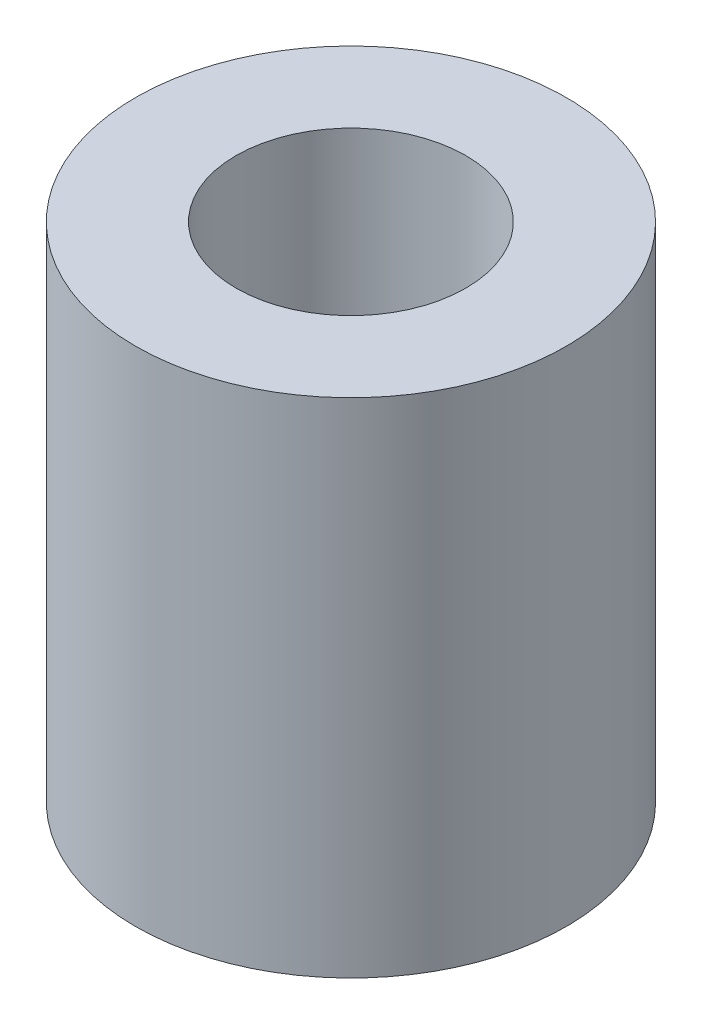
ISO-10303-21;
HEADER;
FILE_DESCRIPTION(('STEP AP214'),'2;1');
FILE_NAME('part.step','',(''),(''),'','','');
FILE_SCHEMA(('AUTOMOTIVE_DESIGN { 1 0 10303 214 1 1 1 1 }'));
ENDSEC;
DATA;
#1=APPLICATION_CONTEXT('core data for automotive mechanical design processes');
#2=APPLICATION_PROTOCOL_DEFINITION('international standard','automotive_design',2000,#1);
#3=PRODUCT_CONTEXT('',#1,'mechanical');
#4=PRODUCT('Part','Part','',(#3));
#5=PRODUCT_RELATED_PRODUCT_CATEGORY('part','',(#4));
#6=PRODUCT_DEFINITION_FORMATION('','',#4);
#7=PRODUCT_DEFINITION_CONTEXT('part definition',#1,'design');
#8=PRODUCT_DEFINITION('design','',#6,#7);
#9=PRODUCT_DEFINITION_SHAPE('','',#8);
#10=(LENGTH_UNIT() NAMED_UNIT(*) SI_UNIT(.MILLI.,.METRE.));
#11=(NAMED_UNIT(*) PLANE_ANGLE_UNIT() SI_UNIT($,.RADIAN.));
#12=(NAMED_UNIT(*) SI_UNIT($,.STERADIAN.) SOLID_ANGLE_UNIT());
#13=UNCERTAINTY_MEASURE_WITH_UNIT(LENGTH_MEASURE(1.E-05),#10,'distance_accuracy_value','');
#14=(GEOMETRIC_REPRESENTATION_CONTEXT(3) GLOBAL_UNCERTAINTY_ASSIGNED_CONTEXT((#13)) GLOBAL_UNIT_ASSIGNED_CONTEXT((#10,
#11,#12)) REPRESENTATION_CONTEXT('',''));
#15=CARTESIAN_POINT('',(0.,0.,0.));
#16=DIRECTION('',(0.,0.,1.));
#17=DIRECTION('',(1.,0.,0.));
#18=AXIS2_PLACEMENT_3D('',#15,#16,#17);
#19=CARTESIAN_POINT('',(0.,10.,0.));
#20=DIRECTION('',(0.,-1.,0.));
#21=DIRECTION('',(0.,0.,-1.));
#22=AXIS2_PLACEMENT_3D('',#19,#20,#21);
#23=CYLINDRICAL_SURFACE('',#22,3.5);
#24=CARTESIAN_POINT('',(0.,0.,0.));
#25=DIRECTION('',(0.,-1.,0.));
#26=DIRECTION('',(0.,0.,-1.));
#27=AXIS2_PLACEMENT_3D('',#24,#25,#26);
#28=CIRCLE('',#27,3.5);
#29=CARTESIAN_POINT('',(0.,0.,-3.5));
#30=VERTEX_POINT('',#29);
#31=EDGE_CURVE('E54',#30,#30,#28,.T.);
#32=ORIENTED_EDGE('',*,*,#31,.T.);
#33=EDGE_LOOP('',(#32));
#34=FACE_BOUND('',#33,.T.);
#35=CARTESIAN_POINT('',(0.,3.,0.));
#36=DIRECTION('',(0.,1.,0.));
#37=DIRECTION('',(0.,0.,1.));
#38=AXIS2_PLACEMENT_3D('',#35,#36,#37);
#39=CIRCLE('',#38,3.5);
#40=CARTESIAN_POINT('',(0.,3.,3.5));
#41=VERTEX_POINT('',#40);
#42=EDGE_CURVE('E43',#41,#41,#39,.F.);
#43=ORIENTED_EDGE('',*,*,#42,.F.);
#44=EDGE_LOOP('',(#43));
#45=FACE_BOUND('',#44,.T.);
#46=ADVANCED_FACE('F39',(#34,#45),#23,.F.);
#47=CARTESIAN_POINT('',(0.,35.,0.));
#48=DIRECTION('',(0.,-1.,0.));
#49=DIRECTION('',(0.,0.,-1.));
#50=AXIS2_PLACEMENT_3D('',#47,#48,#49);
#51=CYLINDRICAL_SURFACE('',#50,15.);
#52=CARTESIAN_POINT('',(0.,35.,0.));
#53=DIRECTION('',(0.,1.,0.));
#54=DIRECTION('',(0.,0.,1.));
#55=AXIS2_PLACEMENT_3D('',#52,#53,#54);
#56=CIRCLE('',#55,15.);
#57=CARTESIAN_POINT('',(0.,35.,15.));
#58=VERTEX_POINT('',#57);
#59=EDGE_CURVE('E10',#58,#58,#56,.T.);
#60=ORIENTED_EDGE('',*,*,#59,.F.);
#61=EDGE_LOOP('',(#60));
#62=FACE_BOUND('',#61,.T.);
#63=CARTESIAN_POINT('',(0.,0.,0.));
#64=DIRECTION('',(0.,1.,0.));
#65=DIRECTION('',(0.,0.,1.));
#66=AXIS2_PLACEMENT_3D('',#63,#64,#65);
#67=CIRCLE('',#66,15.);
#68=CARTESIAN_POINT('',(0.,0.,15.));
#69=VERTEX_POINT('',#68);
#70=EDGE_CURVE('E48',#69,#69,#67,.T.);
#71=ORIENTED_EDGE('',*,*,#70,.T.);
#72=EDGE_LOOP('',(#71));
#73=FACE_BOUND('',#72,.T.);
#74=ADVANCED_FACE('F41',(#62,#73),#51,.T.);
#75=CARTESIAN_POINT('',(0.,35.,0.));
#76=DIRECTION('',(0.,1.,0.));
#77=DIRECTION('',(0.,0.,1.));
#78=AXIS2_PLACEMENT_3D('',#75,#76,#77);
#79=PLANE('',#78);
#80=CARTESIAN_POINT('',(0.,35.,0.));
#81=DIRECTION('',(0.,1.,0.));
#82=DIRECTION('',(0.,0.,1.));
#83=AXIS2_PLACEMENT_3D('',#80,#81,#82);
#84=CIRCLE('',#83,8.);
#85=CARTESIAN_POINT('',(0.,35.,8.));
#86=VERTEX_POINT('',#85);
#87=EDGE_CURVE('E59',#86,#86,#84,.T.);
#88=ORIENTED_EDGE('',*,*,#87,.F.);
#89=EDGE_LOOP('',(#88));
#90=FACE_BOUND('',#89,.T.);
#91=ORIENTED_EDGE('',*,*,#59,.T.);
#92=EDGE_LOOP('',(#91));
#93=FACE_BOUND('',#92,.T.);
#94=ADVANCED_FACE('F80',(#90,#93),#79,.T.);
#95=CARTESIAN_POINT('',(0.,0.,0.));
#96=DIRECTION('',(0.,1.,0.));
#97=DIRECTION('',(0.,0.,1.));
#98=AXIS2_PLACEMENT_3D('',#95,#96,#97);
#99=PLANE('',#98);
#100=ORIENTED_EDGE('',*,*,#31,.F.);
#101=EDGE_LOOP('',(#100));
#102=FACE_BOUND('',#101,.T.);
#103=ORIENTED_EDGE('',*,*,#70,.F.);
#104=EDGE_LOOP('',(#103));
#105=FACE_BOUND('',#104,.T.);
#106=ADVANCED_FACE('F87',(#102,#105),#99,.F.);
#107=CARTESIAN_POINT('',(0.,3.,0.));
#108=DIRECTION('',(0.,1.,0.));
#109=DIRECTION('',(0.,0.,1.));
#110=AXIS2_PLACEMENT_3D('',#107,#108,#109);
#111=PLANE('',#110);
#112=CARTESIAN_POINT('',(0.,3.,0.));
#113=DIRECTION('',(0.,1.,0.));
#114=DIRECTION('',(0.,0.,1.));
#115=AXIS2_PLACEMENT_3D('',#112,#113,#114);
#116=CIRCLE('',#115,8.);
#117=CARTESIAN_POINT('',(0.,3.,8.));
#118=VERTEX_POINT('',#117);
#119=EDGE_CURVE('E63',#118,#118,#116,.T.);
#120=ORIENTED_EDGE('',*,*,#119,.T.);
#121=EDGE_LOOP('',(#120));
#122=FACE_BOUND('',#121,.T.);
#123=ORIENTED_EDGE('',*,*,#42,.T.);
#124=EDGE_LOOP('',(#123));
#125=FACE_BOUND('',#124,.T.);
#126=ADVANCED_FACE('F72',(#122,#125),#111,.T.);
#127=CARTESIAN_POINT('',(0.,3.,0.));
#128=DIRECTION('',(0.,1.,0.));
#129=DIRECTION('',(0.,0.,1.));
#130=AXIS2_PLACEMENT_3D('',#127,#128,#129);
#131=CYLINDRICAL_SURFACE('',#130,8.);
#132=ORIENTED_EDGE('',*,*,#119,.F.);
#133=EDGE_LOOP('',(#132));
#134=FACE_BOUND('',#133,.T.);
#135=ORIENTED_EDGE('',*,*,#87,.T.);
#136=EDGE_LOOP('',(#135));
#137=FACE_BOUND('',#136,.T.);
#138=ADVANCED_FACE('F84',(#134,#137),#131,.F.);
#139=CLOSED_SHELL('',(#46,#74,#94,#106,#126,#138));
#140=MANIFOLD_SOLID_BREP('B2',#139);
#141=ADVANCED_BREP_SHAPE_REPRESENTATION('',(#18,#140),#14);
#142=SHAPE_DEFINITION_REPRESENTATION(#9,#141);
ENDSEC;
END-ISO-10303-21;
